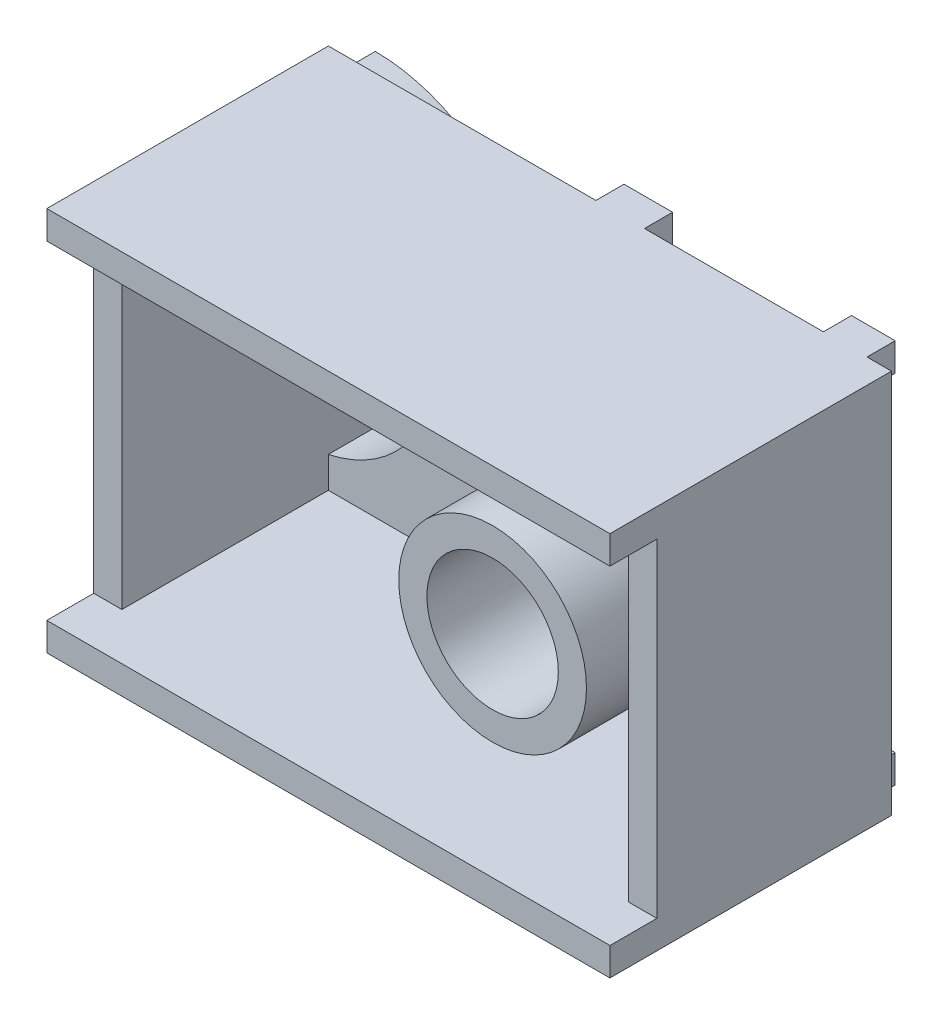
ISO-10303-21;
HEADER;
FILE_DESCRIPTION(('STEP AP214'),'2;1');
FILE_NAME('part.step','',(''),(''),'','','');
FILE_SCHEMA(('AUTOMOTIVE_DESIGN { 1 0 10303 214 1 1 1 1 }'));
ENDSEC;
DATA;
#1=APPLICATION_CONTEXT('core data for automotive mechanical design processes');
#2=APPLICATION_PROTOCOL_DEFINITION('international standard','automotive_design',2000,#1);
#3=PRODUCT_CONTEXT('',#1,'mechanical');
#4=PRODUCT('Part','Part','',(#3));
#5=PRODUCT_RELATED_PRODUCT_CATEGORY('part','',(#4));
#6=PRODUCT_DEFINITION_FORMATION('','',#4);
#7=PRODUCT_DEFINITION_CONTEXT('part definition',#1,'design');
#8=PRODUCT_DEFINITION('design','',#6,#7);
#9=PRODUCT_DEFINITION_SHAPE('','',#8);
#10=(LENGTH_UNIT() NAMED_UNIT(*) SI_UNIT(.MILLI.,.METRE.));
#11=(NAMED_UNIT(*) PLANE_ANGLE_UNIT() SI_UNIT($,.RADIAN.));
#12=(NAMED_UNIT(*) SI_UNIT($,.STERADIAN.) SOLID_ANGLE_UNIT());
#13=UNCERTAINTY_MEASURE_WITH_UNIT(LENGTH_MEASURE(1.E-05),#10,'distance_accuracy_value','');
#14=(GEOMETRIC_REPRESENTATION_CONTEXT(3) GLOBAL_UNCERTAINTY_ASSIGNED_CONTEXT((#13)) GLOBAL_UNIT_ASSIGNED_CONTEXT((#10,
#11,#12)) REPRESENTATION_CONTEXT('',''));
#15=CARTESIAN_POINT('',(0.,0.,0.));
#16=DIRECTION('',(0.,0.,1.));
#17=DIRECTION('',(1.,0.,0.));
#18=AXIS2_PLACEMENT_3D('',#15,#16,#17);
#19=CARTESIAN_POINT('',(0.,0.,25.));
#20=DIRECTION('',(0.,0.,1.));
#21=DIRECTION('',(1.,0.,0.));
#22=AXIS2_PLACEMENT_3D('',#19,#20,#21);
#23=PLANE('',#22);
#24=DIRECTION('',(0.,1.,0.));
#25=VECTOR('',#24,1.);
#26=CARTESIAN_POINT('',(28.5,0.,25.));
#27=LINE('',#26,#25);
#28=CARTESIAN_POINT('',(28.5,-17.5,25.));
#29=VERTEX_POINT('',#28);
#30=CARTESIAN_POINT('',(28.5,17.5,25.));
#31=VERTEX_POINT('',#30);
#32=EDGE_CURVE('E271',#29,#31,#27,.T.);
#33=ORIENTED_EDGE('',*,*,#32,.F.);
#34=DIRECTION('',(-1.,0.,0.));
#35=VECTOR('',#34,1.);
#36=CARTESIAN_POINT('',(0.,-17.5,25.));
#37=LINE('',#36,#35);
#38=CARTESIAN_POINT('',(31.5,-17.5,25.));
#39=VERTEX_POINT('',#38);
#40=EDGE_CURVE('E46',#39,#29,#37,.T.);
#41=ORIENTED_EDGE('',*,*,#40,.F.);
#42=DIRECTION('',(0.,1.,0.));
#43=VECTOR('',#42,1.);
#44=CARTESIAN_POINT('',(31.5,0.,25.));
#45=LINE('',#44,#43);
#46=CARTESIAN_POINT('',(31.5,17.5,25.));
#47=VERTEX_POINT('',#46);
#48=EDGE_CURVE('E11',#39,#47,#45,.T.);
#49=ORIENTED_EDGE('',*,*,#48,.T.);
#50=DIRECTION('',(1.,0.,0.));
#51=VECTOR('',#50,1.);
#52=CARTESIAN_POINT('',(0.,17.5,25.));
#53=LINE('',#52,#51);
#54=EDGE_CURVE('E481',#31,#47,#53,.T.);
#55=ORIENTED_EDGE('',*,*,#54,.F.);
#56=EDGE_LOOP('',(#33,#41,#49,#55));
#57=FACE_BOUND('',#56,.T.);
#58=ADVANCED_FACE('F37',(#57),#23,.T.);
#59=CARTESIAN_POINT('',(13.9999999999999,0.,25.));
#60=DIRECTION('',(0.,0.,1.));
#61=DIRECTION('',(1.,0.,0.));
#62=AXIS2_PLACEMENT_3D('',#59,#60,#61);
#63=CIRCLE('',#62,6.99999999999995);
#64=CARTESIAN_POINT('',(20.9999999999999,0.,25.));
#65=VERTEX_POINT('',#64);
#66=EDGE_CURVE('E478',#65,#65,#63,.T.);
#67=ORIENTED_EDGE('',*,*,#66,.F.);
#68=EDGE_LOOP('',(#67));
#69=FACE_BOUND('',#68,.T.);
#70=CARTESIAN_POINT('',(13.9999999999999,0.,25.));
#71=DIRECTION('',(0.,0.,1.));
#72=DIRECTION('',(1.,0.,0.));
#73=AXIS2_PLACEMENT_3D('',#70,#71,#72);
#74=CIRCLE('',#73,9.99999999999995);
#75=CARTESIAN_POINT('',(23.9999999999999,0.,25.));
#76=VERTEX_POINT('',#75);
#77=EDGE_CURVE('E266',#76,#76,#74,.T.);
#78=ORIENTED_EDGE('',*,*,#77,.T.);
#79=EDGE_LOOP('',(#78));
#80=FACE_BOUND('',#79,.T.);
#81=ADVANCED_FACE('F569',(#69,#80),#23,.T.);
#82=CARTESIAN_POINT('',(0.,0.,0.));
#83=DIRECTION('',(0.,0.,1.));
#84=DIRECTION('',(1.,0.,0.));
#85=AXIS2_PLACEMENT_3D('',#82,#83,#84);
#86=PLANE('',#85);
#87=CARTESIAN_POINT('',(13.9999999999999,0.,0.));
#88=DIRECTION('',(0.,0.,1.));
#89=DIRECTION('',(1.,0.,0.));
#90=AXIS2_PLACEMENT_3D('',#87,#88,#89);
#91=CIRCLE('',#90,6.99999999999995);
#92=CARTESIAN_POINT('',(20.9999999999999,0.,0.));
#93=VERTEX_POINT('',#92);
#94=EDGE_CURVE('E475',#93,#93,#91,.T.);
#95=ORIENTED_EDGE('',*,*,#94,.T.);
#96=EDGE_LOOP('',(#95));
#97=FACE_BOUND('',#96,.T.);
#98=DIRECTION('',(0.,1.,0.));
#99=VECTOR('',#98,1.);
#100=CARTESIAN_POINT('',(24.2435404375954,0.,0.));
#101=LINE('',#100,#99);
#102=CARTESIAN_POINT('',(24.2435404375954,17.5,0.));
#103=VERTEX_POINT('',#102);
#104=CARTESIAN_POINT('',(24.2435404375954,20.5,0.));
#105=VERTEX_POINT('',#104);
#106=EDGE_CURVE('E62',#103,#105,#101,.T.);
#107=ORIENTED_EDGE('',*,*,#106,.F.);
#108=DIRECTION('',(-1.,0.,0.));
#109=VECTOR('',#108,1.);
#110=CARTESIAN_POINT('',(0.,17.5,0.));
#111=LINE('',#110,#109);
#112=CARTESIAN_POINT('',(28.8955762469527,17.5,0.));
#113=VERTEX_POINT('',#112);
#114=EDGE_CURVE('E286',#113,#103,#111,.T.);
#115=ORIENTED_EDGE('',*,*,#114,.F.);
#116=DIRECTION('',(0.,1.,0.));
#117=VECTOR('',#116,1.);
#118=CARTESIAN_POINT('',(28.8955762469527,0.,0.));
#119=LINE('',#118,#117);
#120=CARTESIAN_POINT('',(28.8955762469527,20.5,0.));
#121=VERTEX_POINT('',#120);
#122=EDGE_CURVE('E303',#113,#121,#119,.T.);
#123=ORIENTED_EDGE('',*,*,#122,.T.);
#124=DIRECTION('',(1.,0.,0.));
#125=VECTOR('',#124,1.);
#126=CARTESIAN_POINT('',(0.,20.5,0.));
#127=LINE('',#126,#125);
#128=CARTESIAN_POINT('',(31.5,20.5,0.));
#129=VERTEX_POINT('',#128);
#130=EDGE_CURVE('E435',#121,#129,#127,.T.);
#131=ORIENTED_EDGE('',*,*,#130,.T.);
#132=DIRECTION('',(0.,1.,0.));
#133=VECTOR('',#132,1.);
#134=CARTESIAN_POINT('',(31.5,0.,0.));
#135=LINE('',#134,#133);
#136=CARTESIAN_POINT('',(31.5,-20.5,0.));
#137=VERTEX_POINT('',#136);
#138=EDGE_CURVE('E41',#137,#129,#135,.T.);
#139=ORIENTED_EDGE('',*,*,#138,.F.);
#140=DIRECTION('',(-1.,0.,0.));
#141=VECTOR('',#140,1.);
#142=CARTESIAN_POINT('',(0.,-20.5,0.));
#143=LINE('',#142,#141);
#144=CARTESIAN_POINT('',(28.8955762469527,-20.5,0.));
#145=VERTEX_POINT('',#144);
#146=EDGE_CURVE('E420',#137,#145,#143,.T.);
#147=ORIENTED_EDGE('',*,*,#146,.T.);
#148=DIRECTION('',(0.,1.,0.));
#149=VECTOR('',#148,1.);
#150=CARTESIAN_POINT('',(28.8955762469527,0.,0.));
#151=LINE('',#150,#149);
#152=CARTESIAN_POINT('',(28.8955762469527,-17.5,0.));
#153=VERTEX_POINT('',#152);
#154=EDGE_CURVE('E369',#145,#153,#151,.T.);
#155=ORIENTED_EDGE('',*,*,#154,.T.);
#156=DIRECTION('',(1.,0.,0.));
#157=VECTOR('',#156,1.);
#158=CARTESIAN_POINT('',(0.,-17.5,0.));
#159=LINE('',#158,#157);
#160=CARTESIAN_POINT('',(24.2435404375954,-17.5,0.));
#161=VERTEX_POINT('',#160);
#162=EDGE_CURVE('E391',#161,#153,#159,.T.);
#163=ORIENTED_EDGE('',*,*,#162,.F.);
#164=DIRECTION('',(0.,1.,0.));
#165=VECTOR('',#164,1.);
#166=CARTESIAN_POINT('',(24.2435404375954,0.,0.));
#167=LINE('',#166,#165);
#168=CARTESIAN_POINT('',(24.2435404375954,-20.5,0.));
#169=VERTEX_POINT('',#168);
#170=EDGE_CURVE('E382',#169,#161,#167,.T.);
#171=ORIENTED_EDGE('',*,*,#170,.F.);
#172=CARTESIAN_POINT('',(5.18102434088519,-20.5,0.));
#173=VERTEX_POINT('',#172);
#174=EDGE_CURVE('E422',#169,#173,#143,.T.);
#175=ORIENTED_EDGE('',*,*,#174,.T.);
#176=DIRECTION('',(0.,1.,0.));
#177=VECTOR('',#176,1.);
#178=CARTESIAN_POINT('',(5.18102434088519,0.,0.));
#179=LINE('',#178,#177);
#180=CARTESIAN_POINT('',(5.18102434088519,-17.5,0.));
#181=VERTEX_POINT('',#180);
#182=EDGE_CURVE('E339',#173,#181,#179,.T.);
#183=ORIENTED_EDGE('',*,*,#182,.T.);
#184=DIRECTION('',(-1.,0.,0.));
#185=VECTOR('',#184,1.);
#186=CARTESIAN_POINT('',(0.,-17.5,0.));
#187=LINE('',#186,#185);
#188=CARTESIAN_POINT('',(0.,-17.5,0.));
#189=VERTEX_POINT('',#188);
#190=EDGE_CURVE('E362',#181,#189,#187,.T.);
#191=ORIENTED_EDGE('',*,*,#190,.T.);
#192=DIRECTION('',(0.,1.,0.));
#193=VECTOR('',#192,1.);
#194=CARTESIAN_POINT('',(0.,0.,0.));
#195=LINE('',#194,#193);
#196=CARTESIAN_POINT('',(0.,-20.5,0.));
#197=VERTEX_POINT('',#196);
#198=EDGE_CURVE('E352',#197,#189,#195,.T.);
#199=ORIENTED_EDGE('',*,*,#198,.F.);
#200=CARTESIAN_POINT('',(-28.4999999999998,-20.5,0.));
#201=VERTEX_POINT('',#200);
#202=EDGE_CURVE('E399',#197,#201,#143,.T.);
#203=ORIENTED_EDGE('',*,*,#202,.T.);
#204=DIRECTION('',(0.,-1.,0.));
#205=VECTOR('',#204,1.);
#206=CARTESIAN_POINT('',(-28.4999999999999,0.,0.));
#207=LINE('',#206,#205);
#208=CARTESIAN_POINT('',(-28.4999999999998,-17.5,0.));
#209=VERTEX_POINT('',#208);
#210=EDGE_CURVE('E412',#209,#201,#207,.T.);
#211=ORIENTED_EDGE('',*,*,#210,.F.);
#212=CARTESIAN_POINT('',(-28.4999999999999,0.,0.));
#213=DIRECTION('',(0.,0.,1.));
#214=DIRECTION('',(1.,0.,0.));
#215=AXIS2_PLACEMENT_3D('',#212,#213,#214);
#216=CIRCLE('',#215,17.5);
#217=CARTESIAN_POINT('',(-28.4999999999999,17.5,0.));
#218=VERTEX_POINT('',#217);
#219=EDGE_CURVE('E463',#218,#209,#216,.F.);
#220=ORIENTED_EDGE('',*,*,#219,.F.);
#221=DIRECTION('',(0.,1.,0.));
#222=VECTOR('',#221,1.);
#223=CARTESIAN_POINT('',(-28.4999999999999,0.,0.));
#224=LINE('',#223,#222);
#225=CARTESIAN_POINT('',(-28.4999999999999,20.5,0.));
#226=VERTEX_POINT('',#225);
#227=EDGE_CURVE('E440',#218,#226,#224,.T.);
#228=ORIENTED_EDGE('',*,*,#227,.T.);
#229=CARTESIAN_POINT('',(0.,20.5,0.));
#230=VERTEX_POINT('',#229);
#231=EDGE_CURVE('E449',#226,#230,#127,.T.);
#232=ORIENTED_EDGE('',*,*,#231,.T.);
#233=DIRECTION('',(0.,1.,0.));
#234=VECTOR('',#233,1.);
#235=CARTESIAN_POINT('',(0.,0.,0.));
#236=LINE('',#235,#234);
#237=CARTESIAN_POINT('',(0.,17.5,0.));
#238=VERTEX_POINT('',#237);
#239=EDGE_CURVE('E322',#238,#230,#236,.T.);
#240=ORIENTED_EDGE('',*,*,#239,.F.);
#241=DIRECTION('',(1.,0.,0.));
#242=VECTOR('',#241,1.);
#243=CARTESIAN_POINT('',(0.,17.5,0.));
#244=LINE('',#243,#242);
#245=CARTESIAN_POINT('',(5.18102434088519,17.5,0.));
#246=VERTEX_POINT('',#245);
#247=EDGE_CURVE('E309',#238,#246,#244,.T.);
#248=ORIENTED_EDGE('',*,*,#247,.T.);
#249=DIRECTION('',(0.,1.,0.));
#250=VECTOR('',#249,1.);
#251=CARTESIAN_POINT('',(5.18102434088519,0.,0.));
#252=LINE('',#251,#250);
#253=CARTESIAN_POINT('',(5.18102434088519,20.5,0.));
#254=VERTEX_POINT('',#253);
#255=EDGE_CURVE('E331',#246,#254,#252,.T.);
#256=ORIENTED_EDGE('',*,*,#255,.T.);
#257=EDGE_CURVE('E451',#254,#105,#127,.T.);
#258=ORIENTED_EDGE('',*,*,#257,.T.);
#259=EDGE_LOOP('',(#107,#115,#123,#131,#139,#147,#155,#163,#171,#175,#183,#191,#199,#203,#211,
#220,#228,#232,#240,#248,#256,#258));
#260=FACE_BOUND('',#259,.T.);
#261=ADVANCED_FACE('F526',(#97,#260),#86,.F.);
#262=CARTESIAN_POINT('',(-28.4999999999999,0.,25.));
#263=DIRECTION('',(1.,0.,0.));
#264=DIRECTION('',(0.,1.,0.));
#265=AXIS2_PLACEMENT_3D('',#262,#263,#264);
#266=PLANE('',#265);
#267=DIRECTION('',(0.,-1.,0.));
#268=VECTOR('',#267,1.);
#269=CARTESIAN_POINT('',(-28.4999999999999,0.,25.));
#270=LINE('',#269,#268);
#271=CARTESIAN_POINT('',(-28.4999999999999,17.5,25.));
#272=VERTEX_POINT('',#271);
#273=CARTESIAN_POINT('',(-28.4999999999998,-17.5,25.));
#274=VERTEX_POINT('',#273);
#275=EDGE_CURVE('E484',#272,#274,#270,.T.);
#276=ORIENTED_EDGE('',*,*,#275,.F.);
#277=DIRECTION('',(0.,0.,-1.));
#278=VECTOR('',#277,1.);
#279=CARTESIAN_POINT('',(-28.4999999999999,17.5,30.));
#280=LINE('',#279,#278);
#281=CARTESIAN_POINT('',(-28.4999999999999,17.5,30.));
#282=VERTEX_POINT('',#281);
#283=EDGE_CURVE('E448',#282,#272,#280,.T.);
#284=ORIENTED_EDGE('',*,*,#283,.F.);
#285=DIRECTION('',(0.,1.,0.));
#286=VECTOR('',#285,1.);
#287=CARTESIAN_POINT('',(-28.4999999999999,0.,30.));
#288=LINE('',#287,#286);
#289=CARTESIAN_POINT('',(-28.4999999999999,20.5,30.));
#290=VERTEX_POINT('',#289);
#291=EDGE_CURVE('E445',#282,#290,#288,.T.);
#292=ORIENTED_EDGE('',*,*,#291,.T.);
#293=DIRECTION('',(0.,0.,-1.));
#294=VECTOR('',#293,1.);
#295=CARTESIAN_POINT('',(-28.4999999999999,20.5,30.));
#296=LINE('',#295,#294);
#297=EDGE_CURVE('E455',#290,#226,#296,.T.);
#298=ORIENTED_EDGE('',*,*,#297,.T.);
#299=ORIENTED_EDGE('',*,*,#227,.F.);
#300=DIRECTION('',(0.,0.,1.));
#301=VECTOR('',#300,1.);
#302=CARTESIAN_POINT('',(-28.4999999999999,17.5,-5.));
#303=LINE('',#302,#301);
#304=CARTESIAN_POINT('',(-28.4999999999999,17.5,-5.));
#305=VERTEX_POINT('',#304);
#306=EDGE_CURVE('E469',#305,#218,#303,.T.);
#307=ORIENTED_EDGE('',*,*,#306,.F.);
#308=DIRECTION('',(0.,-1.,0.));
#309=VECTOR('',#308,1.);
#310=CARTESIAN_POINT('',(-28.4999999999999,0.,-5.));
#311=LINE('',#310,#309);
#312=CARTESIAN_POINT('',(-28.4999999999998,-17.5,-5.));
#313=VERTEX_POINT('',#312);
#314=EDGE_CURVE('E466',#305,#313,#311,.T.);
#315=ORIENTED_EDGE('',*,*,#314,.T.);
#316=DIRECTION('',(0.,0.,1.));
#317=VECTOR('',#316,1.);
#318=CARTESIAN_POINT('',(-28.4999999999998,-17.5,-5.));
#319=LINE('',#318,#317);
#320=EDGE_CURVE('E472',#313,#209,#319,.T.);
#321=ORIENTED_EDGE('',*,*,#320,.T.);
#322=ORIENTED_EDGE('',*,*,#210,.T.);
#323=DIRECTION('',(0.,0.,-1.));
#324=VECTOR('',#323,1.);
#325=CARTESIAN_POINT('',(-28.4999999999998,-20.5,30.));
#326=LINE('',#325,#324);
#327=CARTESIAN_POINT('',(-28.4999999999998,-20.5,30.));
#328=VERTEX_POINT('',#327);
#329=EDGE_CURVE('E419',#328,#201,#326,.T.);
#330=ORIENTED_EDGE('',*,*,#329,.F.);
#331=DIRECTION('',(0.,-1.,0.));
#332=VECTOR('',#331,1.);
#333=CARTESIAN_POINT('',(-28.4999999999999,0.,30.));
#334=LINE('',#333,#332);
#335=CARTESIAN_POINT('',(-28.4999999999998,-17.5,30.));
#336=VERTEX_POINT('',#335);
#337=EDGE_CURVE('E417',#336,#328,#334,.T.);
#338=ORIENTED_EDGE('',*,*,#337,.F.);
#339=DIRECTION('',(0.,0.,-1.));
#340=VECTOR('',#339,1.);
#341=CARTESIAN_POINT('',(-28.4999999999998,-17.5,30.));
#342=LINE('',#341,#340);
#343=EDGE_CURVE('E427',#336,#274,#342,.T.);
#344=ORIENTED_EDGE('',*,*,#343,.T.);
#345=EDGE_LOOP('',(#276,#284,#292,#298,#299,#307,#315,#321,#322,#330,#338,#344));
#346=FACE_BOUND('',#345,.T.);
#347=ADVANCED_FACE('F506',(#346),#266,.F.);
#348=CARTESIAN_POINT('',(13.9999999999999,0.,25.));
#349=DIRECTION('',(0.,0.,-1.));
#350=DIRECTION('',(-1.,0.,0.));
#351=AXIS2_PLACEMENT_3D('',#348,#349,#350);
#352=CYLINDRICAL_SURFACE('',#351,6.99999999999995);
#353=ORIENTED_EDGE('',*,*,#66,.T.);
#354=EDGE_LOOP('',(#353));
#355=FACE_BOUND('',#354,.T.);
#356=ORIENTED_EDGE('',*,*,#94,.F.);
#357=EDGE_LOOP('',(#356));
#358=FACE_BOUND('',#357,.T.);
#359=ADVANCED_FACE('F39',(#355,#358),#352,.F.);
#360=CARTESIAN_POINT('',(31.5,0.,25.));
#361=DIRECTION('',(-1.,0.,0.));
#362=DIRECTION('',(0.,-1.,0.));
#363=AXIS2_PLACEMENT_3D('',#360,#361,#362);
#364=PLANE('',#363);
#365=ORIENTED_EDGE('',*,*,#138,.T.);
#366=DIRECTION('',(0.,0.,-1.));
#367=VECTOR('',#366,1.);
#368=CARTESIAN_POINT('',(31.5,20.5,30.));
#369=LINE('',#368,#367);
#370=CARTESIAN_POINT('',(31.5,20.5,30.));
#371=VERTEX_POINT('',#370);
#372=EDGE_CURVE('E457',#371,#129,#369,.T.);
#373=ORIENTED_EDGE('',*,*,#372,.F.);
#374=DIRECTION('',(0.,1.,0.));
#375=VECTOR('',#374,1.);
#376=CARTESIAN_POINT('',(31.5,0.,30.));
#377=LINE('',#376,#375);
#378=CARTESIAN_POINT('',(31.5,17.5,30.));
#379=VERTEX_POINT('',#378);
#380=EDGE_CURVE('E439',#379,#371,#377,.T.);
#381=ORIENTED_EDGE('',*,*,#380,.F.);
#382=DIRECTION('',(0.,0.,-1.));
#383=VECTOR('',#382,1.);
#384=CARTESIAN_POINT('',(31.5,17.5,30.));
#385=LINE('',#384,#383);
#386=EDGE_CURVE('E460',#379,#47,#385,.T.);
#387=ORIENTED_EDGE('',*,*,#386,.T.);
#388=ORIENTED_EDGE('',*,*,#48,.F.);
#389=DIRECTION('',(0.,0.,-1.));
#390=VECTOR('',#389,1.);
#391=CARTESIAN_POINT('',(31.5,-17.5,30.));
#392=LINE('',#391,#390);
#393=CARTESIAN_POINT('',(31.5,-17.5,30.));
#394=VERTEX_POINT('',#393);
#395=EDGE_CURVE('E430',#394,#39,#392,.T.);
#396=ORIENTED_EDGE('',*,*,#395,.F.);
#397=DIRECTION('',(0.,-1.,0.));
#398=VECTOR('',#397,1.);
#399=CARTESIAN_POINT('',(31.5,0.,30.));
#400=LINE('',#399,#398);
#401=CARTESIAN_POINT('',(31.5,-20.5,30.));
#402=VERTEX_POINT('',#401);
#403=EDGE_CURVE('E411',#394,#402,#400,.T.);
#404=ORIENTED_EDGE('',*,*,#403,.T.);
#405=DIRECTION('',(0.,0.,-1.));
#406=VECTOR('',#405,1.);
#407=CARTESIAN_POINT('',(31.5,-20.5,30.));
#408=LINE('',#407,#406);
#409=EDGE_CURVE('E432',#402,#137,#408,.T.);
#410=ORIENTED_EDGE('',*,*,#409,.T.);
#411=EDGE_LOOP('',(#365,#373,#381,#387,#388,#396,#404,#410));
#412=FACE_BOUND('',#411,.T.);
#413=ADVANCED_FACE('F495',(#412),#364,.F.);
#414=DIRECTION('',(0.,-1.,0.));
#415=VECTOR('',#414,1.);
#416=CARTESIAN_POINT('',(-25.4999999999999,0.,25.));
#417=LINE('',#416,#415);
#418=CARTESIAN_POINT('',(-25.4999999999999,17.5,25.));
#419=VERTEX_POINT('',#418);
#420=CARTESIAN_POINT('',(-25.4999999999998,-17.5,25.));
#421=VERTEX_POINT('',#420);
#422=EDGE_CURVE('E283',#419,#421,#417,.T.);
#423=ORIENTED_EDGE('',*,*,#422,.F.);
#424=EDGE_CURVE('E482',#272,#419,#53,.T.);
#425=ORIENTED_EDGE('',*,*,#424,.F.);
#426=ORIENTED_EDGE('',*,*,#275,.T.);
#427=EDGE_CURVE('E487',#421,#274,#37,.T.);
#428=ORIENTED_EDGE('',*,*,#427,.F.);
#429=EDGE_LOOP('',(#423,#425,#426,#428));
#430=FACE_BOUND('',#429,.T.);
#431=ADVANCED_FACE('F571',(#430),#23,.T.);
#432=CARTESIAN_POINT('',(-28.4999999999999,0.,-5.));
#433=DIRECTION('',(0.,0.,1.));
#434=DIRECTION('',(1.,0.,0.));
#435=AXIS2_PLACEMENT_3D('',#432,#433,#434);
#436=CYLINDRICAL_SURFACE('',#435,17.5);
#437=ORIENTED_EDGE('',*,*,#219,.T.);
#438=ORIENTED_EDGE('',*,*,#320,.F.);
#439=CARTESIAN_POINT('',(-28.4999999999999,0.,-5.));
#440=DIRECTION('',(0.,0.,1.));
#441=DIRECTION('',(1.,0.,0.));
#442=AXIS2_PLACEMENT_3D('',#439,#440,#441);
#443=CIRCLE('',#442,17.5);
#444=EDGE_CURVE('E464',#305,#313,#443,.F.);
#445=ORIENTED_EDGE('',*,*,#444,.F.);
#446=ORIENTED_EDGE('',*,*,#306,.T.);
#447=EDGE_LOOP('',(#437,#438,#445,#446));
#448=FACE_BOUND('',#447,.T.);
#449=ADVANCED_FACE('F579',(#448),#436,.T.);
#450=CARTESIAN_POINT('',(0.,0.,-5.));
#451=DIRECTION('',(0.,0.,1.));
#452=DIRECTION('',(1.,0.,0.));
#453=AXIS2_PLACEMENT_3D('',#450,#451,#452);
#454=PLANE('',#453);
#455=ORIENTED_EDGE('',*,*,#444,.T.);
#456=ORIENTED_EDGE('',*,*,#314,.F.);
#457=EDGE_LOOP('',(#455,#456));
#458=FACE_BOUND('',#457,.T.);
#459=ADVANCED_FACE('F585',(#458),#454,.F.);
#460=CARTESIAN_POINT('',(0.,17.5,30.));
#461=DIRECTION('',(0.,1.,0.));
#462=DIRECTION('',(-1.,0.,0.));
#463=AXIS2_PLACEMENT_3D('',#460,#461,#462);
#464=PLANE('',#463);
#465=ORIENTED_EDGE('',*,*,#424,.T.);
#466=DIRECTION('',(0.,0.,-1.));
#467=VECTOR('',#466,1.);
#468=CARTESIAN_POINT('',(-25.4999999999999,17.5,30.));
#469=LINE('',#468,#467);
#470=CARTESIAN_POINT('',(-25.4999999999999,17.5,3.));
#471=VERTEX_POINT('',#470);
#472=EDGE_CURVE('E54',#419,#471,#469,.T.);
#473=ORIENTED_EDGE('',*,*,#472,.T.);
#474=DIRECTION('',(1.,0.,0.));
#475=VECTOR('',#474,1.);
#476=CARTESIAN_POINT('',(0.,17.5,3.));
#477=LINE('',#476,#475);
#478=CARTESIAN_POINT('',(28.5,17.5,3.));
#479=VERTEX_POINT('',#478);
#480=EDGE_CURVE('E248',#471,#479,#477,.T.);
#481=ORIENTED_EDGE('',*,*,#480,.T.);
#482=DIRECTION('',(0.,0.,-1.));
#483=VECTOR('',#482,1.);
#484=CARTESIAN_POINT('',(28.5,17.5,25.));
#485=LINE('',#484,#483);
#486=EDGE_CURVE('E253',#31,#479,#485,.T.);
#487=ORIENTED_EDGE('',*,*,#486,.F.);
#488=ORIENTED_EDGE('',*,*,#54,.T.);
#489=ORIENTED_EDGE('',*,*,#386,.F.);
#490=DIRECTION('',(1.,0.,0.));
#491=VECTOR('',#490,1.);
#492=CARTESIAN_POINT('',(0.,17.5,30.));
#493=LINE('',#492,#491);
#494=EDGE_CURVE('E436',#282,#379,#493,.T.);
#495=ORIENTED_EDGE('',*,*,#494,.F.);
#496=ORIENTED_EDGE('',*,*,#283,.T.);
#497=EDGE_LOOP('',(#465,#473,#481,#487,#488,#489,#495,#496));
#498=FACE_BOUND('',#497,.T.);
#499=ADVANCED_FACE('F251',(#498),#464,.F.);
#500=CARTESIAN_POINT('',(0.,20.5,30.));
#501=DIRECTION('',(0.,1.,0.));
#502=DIRECTION('',(-1.,0.,0.));
#503=AXIS2_PLACEMENT_3D('',#500,#501,#502);
#504=PLANE('',#503);
#505=ORIENTED_EDGE('',*,*,#231,.F.);
#506=ORIENTED_EDGE('',*,*,#297,.F.);
#507=DIRECTION('',(1.,0.,0.));
#508=VECTOR('',#507,1.);
#509=CARTESIAN_POINT('',(0.,20.5,30.));
#510=LINE('',#509,#508);
#511=EDGE_CURVE('E442',#290,#371,#510,.T.);
#512=ORIENTED_EDGE('',*,*,#511,.T.);
#513=ORIENTED_EDGE('',*,*,#372,.T.);
#514=ORIENTED_EDGE('',*,*,#130,.F.);
#515=DIRECTION('',(0.,0.,1.));
#516=VECTOR('',#515,1.);
#517=CARTESIAN_POINT('',(28.8955762469527,20.5,-3.));
#518=LINE('',#517,#516);
#519=CARTESIAN_POINT('',(28.8955762469527,20.5,-3.));
#520=VERTEX_POINT('',#519);
#521=EDGE_CURVE('E313',#520,#121,#518,.T.);
#522=ORIENTED_EDGE('',*,*,#521,.F.);
#523=DIRECTION('',(-1.,0.,0.));
#524=VECTOR('',#523,1.);
#525=CARTESIAN_POINT('',(0.,20.5,-3.));
#526=LINE('',#525,#524);
#527=CARTESIAN_POINT('',(24.2435404375954,20.5,-3.));
#528=VERTEX_POINT('',#527);
#529=EDGE_CURVE('E295',#520,#528,#526,.T.);
#530=ORIENTED_EDGE('',*,*,#529,.T.);
#531=DIRECTION('',(0.,0.,1.));
#532=VECTOR('',#531,1.);
#533=CARTESIAN_POINT('',(24.2435404375954,20.5,-3.));
#534=LINE('',#533,#532);
#535=EDGE_CURVE('E310',#528,#105,#534,.T.);
#536=ORIENTED_EDGE('',*,*,#535,.T.);
#537=ORIENTED_EDGE('',*,*,#257,.F.);
#538=DIRECTION('',(0.,0.,1.));
#539=VECTOR('',#538,1.);
#540=CARTESIAN_POINT('',(5.18102434088519,20.5,-3.));
#541=LINE('',#540,#539);
#542=CARTESIAN_POINT('',(5.18102434088519,20.5,-3.));
#543=VERTEX_POINT('',#542);
#544=EDGE_CURVE('E343',#543,#254,#541,.T.);
#545=ORIENTED_EDGE('',*,*,#544,.F.);
#546=DIRECTION('',(1.,0.,0.));
#547=VECTOR('',#546,1.);
#548=CARTESIAN_POINT('',(0.,20.5,-3.));
#549=LINE('',#548,#547);
#550=CARTESIAN_POINT('',(0.,20.5,-3.));
#551=VERTEX_POINT('',#550);
#552=EDGE_CURVE('E325',#551,#543,#549,.T.);
#553=ORIENTED_EDGE('',*,*,#552,.F.);
#554=DIRECTION('',(0.,0.,1.));
#555=VECTOR('',#554,1.);
#556=CARTESIAN_POINT('',(0.,20.5,-3.));
#557=LINE('',#556,#555);
#558=EDGE_CURVE('E340',#551,#230,#557,.T.);
#559=ORIENTED_EDGE('',*,*,#558,.T.);
#560=EDGE_LOOP('',(#505,#506,#512,#513,#514,#522,#530,#536,#537,#545,#553,#559));
#561=FACE_BOUND('',#560,.T.);
#562=ADVANCED_FACE('F499',(#561),#504,.T.);
#563=CARTESIAN_POINT('',(0.,0.,30.));
#564=DIRECTION('',(0.,0.,1.));
#565=DIRECTION('',(1.,0.,0.));
#566=AXIS2_PLACEMENT_3D('',#563,#564,#565);
#567=PLANE('',#566);
#568=ORIENTED_EDGE('',*,*,#494,.T.);
#569=ORIENTED_EDGE('',*,*,#380,.T.);
#570=ORIENTED_EDGE('',*,*,#511,.F.);
#571=ORIENTED_EDGE('',*,*,#291,.F.);
#572=EDGE_LOOP('',(#568,#569,#570,#571));
#573=FACE_BOUND('',#572,.T.);
#574=ADVANCED_FACE('F503',(#573),#567,.T.);
#575=CARTESIAN_POINT('',(0.,-20.5,30.));
#576=DIRECTION('',(0.,-1.,0.));
#577=DIRECTION('',(0.,0.,-1.));
#578=AXIS2_PLACEMENT_3D('',#575,#576,#577);
#579=PLANE('',#578);
#580=ORIENTED_EDGE('',*,*,#146,.F.);
#581=ORIENTED_EDGE('',*,*,#409,.F.);
#582=DIRECTION('',(-1.,0.,0.));
#583=VECTOR('',#582,1.);
#584=CARTESIAN_POINT('',(0.,-20.5,30.));
#585=LINE('',#584,#583);
#586=EDGE_CURVE('E408',#402,#328,#585,.T.);
#587=ORIENTED_EDGE('',*,*,#586,.T.);
#588=ORIENTED_EDGE('',*,*,#329,.T.);
#589=ORIENTED_EDGE('',*,*,#202,.F.);
#590=DIRECTION('',(0.,0.,1.));
#591=VECTOR('',#590,1.);
#592=CARTESIAN_POINT('',(0.,-20.5,-3.));
#593=LINE('',#592,#591);
#594=CARTESIAN_POINT('',(0.,-20.5,-3.));
#595=VERTEX_POINT('',#594);
#596=EDGE_CURVE('E366',#595,#197,#593,.T.);
#597=ORIENTED_EDGE('',*,*,#596,.F.);
#598=DIRECTION('',(-1.,0.,0.));
#599=VECTOR('',#598,1.);
#600=CARTESIAN_POINT('',(0.,-20.5,-3.));
#601=LINE('',#600,#599);
#602=CARTESIAN_POINT('',(5.18102434088519,-20.5,-3.));
#603=VERTEX_POINT('',#602);
#604=EDGE_CURVE('E348',#603,#595,#601,.T.);
#605=ORIENTED_EDGE('',*,*,#604,.F.);
#606=DIRECTION('',(0.,0.,1.));
#607=VECTOR('',#606,1.);
#608=CARTESIAN_POINT('',(5.18102434088519,-20.5,-3.));
#609=LINE('',#608,#607);
#610=EDGE_CURVE('E360',#603,#173,#609,.T.);
#611=ORIENTED_EDGE('',*,*,#610,.T.);
#612=ORIENTED_EDGE('',*,*,#174,.F.);
#613=DIRECTION('',(0.,0.,1.));
#614=VECTOR('',#613,1.);
#615=CARTESIAN_POINT('',(24.2435404375954,-20.5,-3.));
#616=LINE('',#615,#614);
#617=CARTESIAN_POINT('',(24.2435404375954,-20.5,-3.));
#618=VERTEX_POINT('',#617);
#619=EDGE_CURVE('E396',#618,#169,#616,.T.);
#620=ORIENTED_EDGE('',*,*,#619,.F.);
#621=DIRECTION('',(1.,0.,0.));
#622=VECTOR('',#621,1.);
#623=CARTESIAN_POINT('',(0.,-20.5,-3.));
#624=LINE('',#623,#622);
#625=CARTESIAN_POINT('',(28.8955762469527,-20.5,-3.));
#626=VERTEX_POINT('',#625);
#627=EDGE_CURVE('E378',#618,#626,#624,.T.);
#628=ORIENTED_EDGE('',*,*,#627,.T.);
#629=DIRECTION('',(0.,0.,1.));
#630=VECTOR('',#629,1.);
#631=CARTESIAN_POINT('',(28.8955762469527,-20.5,-3.));
#632=LINE('',#631,#630);
#633=EDGE_CURVE('E389',#626,#145,#632,.T.);
#634=ORIENTED_EDGE('',*,*,#633,.T.);
#635=EDGE_LOOP('',(#580,#581,#587,#588,#589,#597,#605,#611,#612,#620,#628,#634));
#636=FACE_BOUND('',#635,.T.);
#637=ADVANCED_FACE('F524',(#636),#579,.T.);
#638=CARTESIAN_POINT('',(0.,-17.5,30.));
#639=DIRECTION('',(0.,-1.,0.));
#640=DIRECTION('',(0.,0.,-1.));
#641=AXIS2_PLACEMENT_3D('',#638,#639,#640);
#642=PLANE('',#641);
#643=ORIENTED_EDGE('',*,*,#40,.T.);
#644=DIRECTION('',(0.,0.,-1.));
#645=VECTOR('',#644,1.);
#646=CARTESIAN_POINT('',(28.5,-17.5,30.));
#647=LINE('',#646,#645);
#648=CARTESIAN_POINT('',(28.5,-17.5,3.));
#649=VERTEX_POINT('',#648);
#650=EDGE_CURVE('E257',#29,#649,#647,.T.);
#651=ORIENTED_EDGE('',*,*,#650,.T.);
#652=DIRECTION('',(-1.,0.,0.));
#653=VECTOR('',#652,1.);
#654=CARTESIAN_POINT('',(0.,-17.5,3.));
#655=LINE('',#654,#653);
#656=CARTESIAN_POINT('',(-25.4999999999998,-17.5,3.));
#657=VERTEX_POINT('',#656);
#658=EDGE_CURVE('E264',#649,#657,#655,.T.);
#659=ORIENTED_EDGE('',*,*,#658,.T.);
#660=DIRECTION('',(0.,0.,-1.));
#661=VECTOR('',#660,1.);
#662=CARTESIAN_POINT('',(-25.4999999999998,-17.5,25.));
#663=LINE('',#662,#661);
#664=EDGE_CURVE('E282',#421,#657,#663,.T.);
#665=ORIENTED_EDGE('',*,*,#664,.F.);
#666=ORIENTED_EDGE('',*,*,#427,.T.);
#667=ORIENTED_EDGE('',*,*,#343,.F.);
#668=DIRECTION('',(-1.,0.,0.));
#669=VECTOR('',#668,1.);
#670=CARTESIAN_POINT('',(0.,-17.5,30.));
#671=LINE('',#670,#669);
#672=EDGE_CURVE('E415',#394,#336,#671,.T.);
#673=ORIENTED_EDGE('',*,*,#672,.F.);
#674=ORIENTED_EDGE('',*,*,#395,.T.);
#675=EDGE_LOOP('',(#643,#651,#659,#665,#666,#667,#673,#674));
#676=FACE_BOUND('',#675,.T.);
#677=ADVANCED_FACE('F514',(#676),#642,.F.);
#678=CARTESIAN_POINT('',(0.,0.,30.));
#679=DIRECTION('',(0.,0.,1.));
#680=DIRECTION('',(1.,0.,0.));
#681=AXIS2_PLACEMENT_3D('',#678,#679,#680);
#682=PLANE('',#681);
#683=ORIENTED_EDGE('',*,*,#586,.F.);
#684=ORIENTED_EDGE('',*,*,#403,.F.);
#685=ORIENTED_EDGE('',*,*,#672,.T.);
#686=ORIENTED_EDGE('',*,*,#337,.T.);
#687=EDGE_LOOP('',(#683,#684,#685,#686));
#688=FACE_BOUND('',#687,.T.);
#689=ADVANCED_FACE('F520',(#688),#682,.T.);
#690=CARTESIAN_POINT('',(24.2435404375954,0.,-3.));
#691=DIRECTION('',(1.,0.,0.));
#692=DIRECTION('',(0.,0.,-1.));
#693=AXIS2_PLACEMENT_3D('',#690,#691,#692);
#694=PLANE('',#693);
#695=ORIENTED_EDGE('',*,*,#170,.T.);
#696=DIRECTION('',(0.,0.,1.));
#697=VECTOR('',#696,1.);
#698=CARTESIAN_POINT('',(24.2435404375954,-17.5,-3.));
#699=LINE('',#698,#697);
#700=CARTESIAN_POINT('',(24.2435404375954,-17.5,-3.));
#701=VERTEX_POINT('',#700);
#702=EDGE_CURVE('E400',#701,#161,#699,.T.);
#703=ORIENTED_EDGE('',*,*,#702,.F.);
#704=DIRECTION('',(0.,1.,0.));
#705=VECTOR('',#704,1.);
#706=CARTESIAN_POINT('',(24.2435404375954,0.,-3.));
#707=LINE('',#706,#705);
#708=EDGE_CURVE('E387',#618,#701,#707,.T.);
#709=ORIENTED_EDGE('',*,*,#708,.F.);
#710=ORIENTED_EDGE('',*,*,#619,.T.);
#711=EDGE_LOOP('',(#695,#703,#709,#710));
#712=FACE_BOUND('',#711,.T.);
#713=ADVANCED_FACE('F538',(#712),#694,.F.);
#714=CARTESIAN_POINT('',(0.,-17.5,-3.));
#715=DIRECTION('',(0.,-1.,0.));
#716=DIRECTION('',(0.,0.,-1.));
#717=AXIS2_PLACEMENT_3D('',#714,#715,#716);
#718=PLANE('',#717);
#719=ORIENTED_EDGE('',*,*,#162,.T.);
#720=DIRECTION('',(0.,0.,1.));
#721=VECTOR('',#720,1.);
#722=CARTESIAN_POINT('',(28.8955762469527,-17.5,-3.));
#723=LINE('',#722,#721);
#724=CARTESIAN_POINT('',(28.8955762469527,-17.5,-3.));
#725=VERTEX_POINT('',#724);
#726=EDGE_CURVE('E403',#725,#153,#723,.T.);
#727=ORIENTED_EDGE('',*,*,#726,.F.);
#728=DIRECTION('',(1.,0.,0.));
#729=VECTOR('',#728,1.);
#730=CARTESIAN_POINT('',(0.,-17.5,-3.));
#731=LINE('',#730,#729);
#732=EDGE_CURVE('E385',#701,#725,#731,.T.);
#733=ORIENTED_EDGE('',*,*,#732,.F.);
#734=ORIENTED_EDGE('',*,*,#702,.T.);
#735=EDGE_LOOP('',(#719,#727,#733,#734));
#736=FACE_BOUND('',#735,.T.);
#737=ADVANCED_FACE('F534',(#736),#718,.F.);
#738=CARTESIAN_POINT('',(28.8955762469527,0.,-3.));
#739=DIRECTION('',(1.,0.,0.));
#740=DIRECTION('',(0.,0.,-1.));
#741=AXIS2_PLACEMENT_3D('',#738,#739,#740);
#742=PLANE('',#741);
#743=ORIENTED_EDGE('',*,*,#154,.F.);
#744=ORIENTED_EDGE('',*,*,#633,.F.);
#745=DIRECTION('',(0.,1.,0.));
#746=VECTOR('',#745,1.);
#747=CARTESIAN_POINT('',(28.8955762469527,0.,-3.));
#748=LINE('',#747,#746);
#749=EDGE_CURVE('E381',#626,#725,#748,.T.);
#750=ORIENTED_EDGE('',*,*,#749,.T.);
#751=ORIENTED_EDGE('',*,*,#726,.T.);
#752=EDGE_LOOP('',(#743,#744,#750,#751));
#753=FACE_BOUND('',#752,.T.);
#754=ADVANCED_FACE('F530',(#753),#742,.T.);
#755=CARTESIAN_POINT('',(0.,0.,-3.));
#756=DIRECTION('',(0.,0.,1.));
#757=DIRECTION('',(1.,0.,0.));
#758=AXIS2_PLACEMENT_3D('',#755,#756,#757);
#759=PLANE('',#758);
#760=ORIENTED_EDGE('',*,*,#627,.F.);
#761=ORIENTED_EDGE('',*,*,#708,.T.);
#762=ORIENTED_EDGE('',*,*,#732,.T.);
#763=ORIENTED_EDGE('',*,*,#749,.F.);
#764=EDGE_LOOP('',(#760,#761,#762,#763));
#765=FACE_BOUND('',#764,.T.);
#766=ADVANCED_FACE('F697',(#765),#759,.F.);
#767=CARTESIAN_POINT('',(0.,0.,-3.));
#768=DIRECTION('',(1.,0.,0.));
#769=DIRECTION('',(0.,0.,-1.));
#770=AXIS2_PLACEMENT_3D('',#767,#768,#769);
#771=PLANE('',#770);
#772=ORIENTED_EDGE('',*,*,#198,.T.);
#773=DIRECTION('',(0.,0.,1.));
#774=VECTOR('',#773,1.);
#775=CARTESIAN_POINT('',(0.,-17.5,-3.));
#776=LINE('',#775,#774);
#777=CARTESIAN_POINT('',(0.,-17.5,-3.));
#778=VERTEX_POINT('',#777);
#779=EDGE_CURVE('E370',#778,#189,#776,.T.);
#780=ORIENTED_EDGE('',*,*,#779,.F.);
#781=DIRECTION('',(0.,1.,0.));
#782=VECTOR('',#781,1.);
#783=CARTESIAN_POINT('',(0.,0.,-3.));
#784=LINE('',#783,#782);
#785=EDGE_CURVE('E358',#595,#778,#784,.T.);
#786=ORIENTED_EDGE('',*,*,#785,.F.);
#787=ORIENTED_EDGE('',*,*,#596,.T.);
#788=EDGE_LOOP('',(#772,#780,#786,#787));
#789=FACE_BOUND('',#788,.T.);
#790=ADVANCED_FACE('F553',(#789),#771,.F.);
#791=CARTESIAN_POINT('',(0.,-17.5,-3.));
#792=DIRECTION('',(0.,1.,0.));
#793=DIRECTION('',(0.,0.,1.));
#794=AXIS2_PLACEMENT_3D('',#791,#792,#793);
#795=PLANE('',#794);
#796=ORIENTED_EDGE('',*,*,#190,.F.);
#797=DIRECTION('',(0.,0.,1.));
#798=VECTOR('',#797,1.);
#799=CARTESIAN_POINT('',(5.18102434088519,-17.5,-3.));
#800=LINE('',#799,#798);
#801=CARTESIAN_POINT('',(5.18102434088519,-17.5,-3.));
#802=VERTEX_POINT('',#801);
#803=EDGE_CURVE('E373',#802,#181,#800,.T.);
#804=ORIENTED_EDGE('',*,*,#803,.F.);
#805=DIRECTION('',(-1.,0.,0.));
#806=VECTOR('',#805,1.);
#807=CARTESIAN_POINT('',(0.,-17.5,-3.));
#808=LINE('',#807,#806);
#809=EDGE_CURVE('E355',#802,#778,#808,.T.);
#810=ORIENTED_EDGE('',*,*,#809,.T.);
#811=ORIENTED_EDGE('',*,*,#779,.T.);
#812=EDGE_LOOP('',(#796,#804,#810,#811));
#813=FACE_BOUND('',#812,.T.);
#814=ADVANCED_FACE('F549',(#813),#795,.T.);
#815=CARTESIAN_POINT('',(5.18102434088519,0.,-3.));
#816=DIRECTION('',(1.,0.,0.));
#817=DIRECTION('',(0.,0.,-1.));
#818=AXIS2_PLACEMENT_3D('',#815,#816,#817);
#819=PLANE('',#818);
#820=ORIENTED_EDGE('',*,*,#182,.F.);
#821=ORIENTED_EDGE('',*,*,#610,.F.);
#822=DIRECTION('',(0.,1.,0.));
#823=VECTOR('',#822,1.);
#824=CARTESIAN_POINT('',(5.18102434088519,0.,-3.));
#825=LINE('',#824,#823);
#826=EDGE_CURVE('E351',#603,#802,#825,.T.);
#827=ORIENTED_EDGE('',*,*,#826,.T.);
#828=ORIENTED_EDGE('',*,*,#803,.T.);
#829=EDGE_LOOP('',(#820,#821,#827,#828));
#830=FACE_BOUND('',#829,.T.);
#831=ADVANCED_FACE('F545',(#830),#819,.T.);
#832=CARTESIAN_POINT('',(0.,0.,-3.));
#833=DIRECTION('',(0.,0.,1.));
#834=DIRECTION('',(1.,0.,0.));
#835=AXIS2_PLACEMENT_3D('',#832,#833,#834);
#836=PLANE('',#835);
#837=ORIENTED_EDGE('',*,*,#604,.T.);
#838=ORIENTED_EDGE('',*,*,#785,.T.);
#839=ORIENTED_EDGE('',*,*,#809,.F.);
#840=ORIENTED_EDGE('',*,*,#826,.F.);
#841=EDGE_LOOP('',(#837,#838,#839,#840));
#842=FACE_BOUND('',#841,.T.);
#843=ADVANCED_FACE('F555',(#842),#836,.F.);
#844=CARTESIAN_POINT('',(0.,17.5,-3.));
#845=DIRECTION('',(0.,-1.,0.));
#846=DIRECTION('',(1.,0.,0.));
#847=AXIS2_PLACEMENT_3D('',#844,#845,#846);
#848=PLANE('',#847);
#849=ORIENTED_EDGE('',*,*,#247,.F.);
#850=DIRECTION('',(0.,0.,1.));
#851=VECTOR('',#850,1.);
#852=CARTESIAN_POINT('',(0.,17.5,-3.));
#853=LINE('',#852,#851);
#854=CARTESIAN_POINT('',(0.,17.5,-3.));
#855=VERTEX_POINT('',#854);
#856=EDGE_CURVE('E336',#855,#238,#853,.T.);
#857=ORIENTED_EDGE('',*,*,#856,.F.);
#858=DIRECTION('',(1.,0.,0.));
#859=VECTOR('',#858,1.);
#860=CARTESIAN_POINT('',(0.,17.5,-3.));
#861=LINE('',#860,#859);
#862=CARTESIAN_POINT('',(5.18102434088519,17.5,-3.));
#863=VERTEX_POINT('',#862);
#864=EDGE_CURVE('E318',#855,#863,#861,.T.);
#865=ORIENTED_EDGE('',*,*,#864,.T.);
#866=DIRECTION('',(0.,0.,1.));
#867=VECTOR('',#866,1.);
#868=CARTESIAN_POINT('',(5.18102434088519,17.5,-3.));
#869=LINE('',#868,#867);
#870=EDGE_CURVE('E329',#863,#246,#869,.T.);
#871=ORIENTED_EDGE('',*,*,#870,.T.);
#872=EDGE_LOOP('',(#849,#857,#865,#871));
#873=FACE_BOUND('',#872,.T.);
#874=ADVANCED_FACE('F557',(#873),#848,.T.);
#875=CARTESIAN_POINT('',(0.,0.,-3.));
#876=DIRECTION('',(1.,0.,0.));
#877=DIRECTION('',(0.,0.,-1.));
#878=AXIS2_PLACEMENT_3D('',#875,#876,#877);
#879=PLANE('',#878);
#880=ORIENTED_EDGE('',*,*,#239,.T.);
#881=ORIENTED_EDGE('',*,*,#558,.F.);
#882=DIRECTION('',(0.,1.,0.));
#883=VECTOR('',#882,1.);
#884=CARTESIAN_POINT('',(0.,0.,-3.));
#885=LINE('',#884,#883);
#886=EDGE_CURVE('E327',#855,#551,#885,.T.);
#887=ORIENTED_EDGE('',*,*,#886,.F.);
#888=ORIENTED_EDGE('',*,*,#856,.T.);
#889=EDGE_LOOP('',(#880,#881,#887,#888));
#890=FACE_BOUND('',#889,.T.);
#891=ADVANCED_FACE('F563',(#890),#879,.F.);
#892=CARTESIAN_POINT('',(5.18102434088519,0.,-3.));
#893=DIRECTION('',(1.,0.,0.));
#894=DIRECTION('',(0.,0.,-1.));
#895=AXIS2_PLACEMENT_3D('',#892,#893,#894);
#896=PLANE('',#895);
#897=ORIENTED_EDGE('',*,*,#255,.F.);
#898=ORIENTED_EDGE('',*,*,#870,.F.);
#899=DIRECTION('',(0.,1.,0.));
#900=VECTOR('',#899,1.);
#901=CARTESIAN_POINT('',(5.18102434088519,0.,-3.));
#902=LINE('',#901,#900);
#903=EDGE_CURVE('E321',#863,#543,#902,.T.);
#904=ORIENTED_EDGE('',*,*,#903,.T.);
#905=ORIENTED_EDGE('',*,*,#544,.T.);
#906=EDGE_LOOP('',(#897,#898,#904,#905));
#907=FACE_BOUND('',#906,.T.);
#908=ADVANCED_FACE('F650',(#907),#896,.T.);
#909=CARTESIAN_POINT('',(0.,0.,-3.));
#910=DIRECTION('',(0.,0.,1.));
#911=DIRECTION('',(1.,0.,0.));
#912=AXIS2_PLACEMENT_3D('',#909,#910,#911);
#913=PLANE('',#912);
#914=ORIENTED_EDGE('',*,*,#864,.F.);
#915=ORIENTED_EDGE('',*,*,#886,.T.);
#916=ORIENTED_EDGE('',*,*,#552,.T.);
#917=ORIENTED_EDGE('',*,*,#903,.F.);
#918=EDGE_LOOP('',(#914,#915,#916,#917));
#919=FACE_BOUND('',#918,.T.);
#920=ADVANCED_FACE('F646',(#919),#913,.F.);
#921=CARTESIAN_POINT('',(0.,17.5,-3.));
#922=DIRECTION('',(0.,1.,0.));
#923=DIRECTION('',(-1.,0.,0.));
#924=AXIS2_PLACEMENT_3D('',#921,#922,#923);
#925=PLANE('',#924);
#926=ORIENTED_EDGE('',*,*,#114,.T.);
#927=DIRECTION('',(0.,0.,1.));
#928=VECTOR('',#927,1.);
#929=CARTESIAN_POINT('',(24.2435404375954,17.5,-3.));
#930=LINE('',#929,#928);
#931=CARTESIAN_POINT('',(24.2435404375954,17.5,-3.));
#932=VERTEX_POINT('',#931);
#933=EDGE_CURVE('E307',#932,#103,#930,.T.);
#934=ORIENTED_EDGE('',*,*,#933,.F.);
#935=DIRECTION('',(-1.,0.,0.));
#936=VECTOR('',#935,1.);
#937=CARTESIAN_POINT('',(0.,17.5,-3.));
#938=LINE('',#937,#936);
#939=CARTESIAN_POINT('',(28.8955762469527,17.5,-3.));
#940=VERTEX_POINT('',#939);
#941=EDGE_CURVE('E289',#940,#932,#938,.T.);
#942=ORIENTED_EDGE('',*,*,#941,.F.);
#943=DIRECTION('',(0.,0.,1.));
#944=VECTOR('',#943,1.);
#945=CARTESIAN_POINT('',(28.8955762469527,17.5,-3.));
#946=LINE('',#945,#944);
#947=EDGE_CURVE('E300',#940,#113,#946,.T.);
#948=ORIENTED_EDGE('',*,*,#947,.T.);
#949=EDGE_LOOP('',(#926,#934,#942,#948));
#950=FACE_BOUND('',#949,.T.);
#951=ADVANCED_FACE('F639',(#950),#925,.F.);
#952=CARTESIAN_POINT('',(24.2435404375954,0.,-3.));
#953=DIRECTION('',(1.,0.,0.));
#954=DIRECTION('',(0.,0.,-1.));
#955=AXIS2_PLACEMENT_3D('',#952,#953,#954);
#956=PLANE('',#955);
#957=ORIENTED_EDGE('',*,*,#106,.T.);
#958=ORIENTED_EDGE('',*,*,#535,.F.);
#959=DIRECTION('',(0.,1.,0.));
#960=VECTOR('',#959,1.);
#961=CARTESIAN_POINT('',(24.2435404375954,0.,-3.));
#962=LINE('',#961,#960);
#963=EDGE_CURVE('E298',#932,#528,#962,.T.);
#964=ORIENTED_EDGE('',*,*,#963,.F.);
#965=ORIENTED_EDGE('',*,*,#933,.T.);
#966=EDGE_LOOP('',(#957,#958,#964,#965));
#967=FACE_BOUND('',#966,.T.);
#968=ADVANCED_FACE('F636',(#967),#956,.F.);
#969=CARTESIAN_POINT('',(28.8955762469527,0.,-3.));
#970=DIRECTION('',(1.,0.,0.));
#971=DIRECTION('',(0.,0.,-1.));
#972=AXIS2_PLACEMENT_3D('',#969,#970,#971);
#973=PLANE('',#972);
#974=ORIENTED_EDGE('',*,*,#122,.F.);
#975=ORIENTED_EDGE('',*,*,#947,.F.);
#976=DIRECTION('',(0.,1.,0.));
#977=VECTOR('',#976,1.);
#978=CARTESIAN_POINT('',(28.8955762469527,0.,-3.));
#979=LINE('',#978,#977);
#980=EDGE_CURVE('E292',#940,#520,#979,.T.);
#981=ORIENTED_EDGE('',*,*,#980,.T.);
#982=ORIENTED_EDGE('',*,*,#521,.T.);
#983=EDGE_LOOP('',(#974,#975,#981,#982));
#984=FACE_BOUND('',#983,.T.);
#985=ADVANCED_FACE('F619',(#984),#973,.T.);
#986=CARTESIAN_POINT('',(0.,0.,-3.));
#987=DIRECTION('',(0.,0.,1.));
#988=DIRECTION('',(1.,0.,0.));
#989=AXIS2_PLACEMENT_3D('',#986,#987,#988);
#990=PLANE('',#989);
#991=ORIENTED_EDGE('',*,*,#941,.T.);
#992=ORIENTED_EDGE('',*,*,#963,.T.);
#993=ORIENTED_EDGE('',*,*,#529,.F.);
#994=ORIENTED_EDGE('',*,*,#980,.F.);
#995=EDGE_LOOP('',(#991,#992,#993,#994));
#996=FACE_BOUND('',#995,.T.);
#997=ADVANCED_FACE('F612',(#996),#990,.F.);
#998=CARTESIAN_POINT('',(0.,0.,3.));
#999=DIRECTION('',(0.,0.,1.));
#1000=DIRECTION('',(1.,0.,0.));
#1001=AXIS2_PLACEMENT_3D('',#998,#999,#1000);
#1002=PLANE('',#1001);
#1003=CARTESIAN_POINT('',(13.9999999999999,0.,3.));
#1004=DIRECTION('',(0.,0.,1.));
#1005=DIRECTION('',(1.,0.,0.));
#1006=AXIS2_PLACEMENT_3D('',#1003,#1004,#1005);
#1007=CIRCLE('',#1006,9.99999999999995);
#1008=CARTESIAN_POINT('',(23.9999999999999,0.,3.));
#1009=VERTEX_POINT('',#1008);
#1010=EDGE_CURVE('E267',#1009,#1009,#1007,.T.);
#1011=ORIENTED_EDGE('',*,*,#1010,.F.);
#1012=EDGE_LOOP('',(#1011));
#1013=FACE_BOUND('',#1012,.T.);
#1014=ORIENTED_EDGE('',*,*,#480,.F.);
#1015=DIRECTION('',(0.,1.,0.));
#1016=VECTOR('',#1015,1.);
#1017=CARTESIAN_POINT('',(-25.4999999999999,0.,3.));
#1018=LINE('',#1017,#1016);
#1019=CARTESIAN_POINT('',(-25.4999999999999,14.1862609591111,3.));
#1020=VERTEX_POINT('',#1019);
#1021=EDGE_CURVE('E256',#1020,#471,#1018,.T.);
#1022=ORIENTED_EDGE('',*,*,#1021,.F.);
#1023=CARTESIAN_POINT('',(-28.4999999999999,0.,3.));
#1024=DIRECTION('',(0.,0.,1.));
#1025=DIRECTION('',(1.,0.,0.));
#1026=AXIS2_PLACEMENT_3D('',#1023,#1024,#1025);
#1027=CIRCLE('',#1026,14.5);
#1028=CARTESIAN_POINT('',(-25.4999999999998,-14.1862609591111,3.));
#1029=VERTEX_POINT('',#1028);
#1030=EDGE_CURVE('E272',#1020,#1029,#1027,.F.);
#1031=ORIENTED_EDGE('',*,*,#1030,.T.);
#1032=DIRECTION('',(0.,-1.,0.));
#1033=VECTOR('',#1032,1.);
#1034=CARTESIAN_POINT('',(-25.4999999999999,0.,3.));
#1035=LINE('',#1034,#1033);
#1036=EDGE_CURVE('E592',#1029,#657,#1035,.T.);
#1037=ORIENTED_EDGE('',*,*,#1036,.T.);
#1038=ORIENTED_EDGE('',*,*,#658,.F.);
#1039=DIRECTION('',(0.,1.,0.));
#1040=VECTOR('',#1039,1.);
#1041=CARTESIAN_POINT('',(28.5,0.,3.));
#1042=LINE('',#1041,#1040);
#1043=EDGE_CURVE('E261',#649,#479,#1042,.T.);
#1044=ORIENTED_EDGE('',*,*,#1043,.T.);
#1045=EDGE_LOOP('',(#1014,#1022,#1031,#1037,#1038,#1044));
#1046=FACE_BOUND('',#1045,.T.);
#1047=ADVANCED_FACE('F262',(#1013,#1046),#1002,.T.);
#1048=CARTESIAN_POINT('',(-25.4999999999999,0.,25.));
#1049=DIRECTION('',(1.,0.,0.));
#1050=DIRECTION('',(0.,1.,0.));
#1051=AXIS2_PLACEMENT_3D('',#1048,#1049,#1050);
#1052=PLANE('',#1051);
#1053=ORIENTED_EDGE('',*,*,#664,.T.);
#1054=ORIENTED_EDGE('',*,*,#1036,.F.);
#1055=DIRECTION('',(0.,0.,1.));
#1056=VECTOR('',#1055,1.);
#1057=CARTESIAN_POINT('',(-25.4999999999998,-14.1862609591111,-2.));
#1058=LINE('',#1057,#1056);
#1059=CARTESIAN_POINT('',(-25.4999999999998,-14.1862609591111,-2.));
#1060=VERTEX_POINT('',#1059);
#1061=EDGE_CURVE('E595',#1060,#1029,#1058,.T.);
#1062=ORIENTED_EDGE('',*,*,#1061,.F.);
#1063=DIRECTION('',(0.,-1.,0.));
#1064=VECTOR('',#1063,1.);
#1065=CARTESIAN_POINT('',(-25.4999999999999,0.,-2.));
#1066=LINE('',#1065,#1064);
#1067=CARTESIAN_POINT('',(-25.4999999999999,14.1862609591111,-2.));
#1068=VERTEX_POINT('',#1067);
#1069=EDGE_CURVE('E599',#1068,#1060,#1066,.T.);
#1070=ORIENTED_EDGE('',*,*,#1069,.F.);
#1071=DIRECTION('',(0.,0.,1.));
#1072=VECTOR('',#1071,1.);
#1073=CARTESIAN_POINT('',(-25.4999999999999,14.1862609591111,-2.));
#1074=LINE('',#1073,#1072);
#1075=EDGE_CURVE('E598',#1068,#1020,#1074,.T.);
#1076=ORIENTED_EDGE('',*,*,#1075,.T.);
#1077=ORIENTED_EDGE('',*,*,#1021,.T.);
#1078=ORIENTED_EDGE('',*,*,#472,.F.);
#1079=ORIENTED_EDGE('',*,*,#422,.T.);
#1080=EDGE_LOOP('',(#1053,#1054,#1062,#1070,#1076,#1077,#1078,#1079));
#1081=FACE_BOUND('',#1080,.T.);
#1082=ADVANCED_FACE('F591',(#1081),#1052,.T.);
#1083=CARTESIAN_POINT('',(13.9999999999999,0.,25.));
#1084=DIRECTION('',(0.,0.,-1.));
#1085=DIRECTION('',(-1.,0.,0.));
#1086=AXIS2_PLACEMENT_3D('',#1083,#1084,#1085);
#1087=CYLINDRICAL_SURFACE('',#1086,9.99999999999995);
#1088=ORIENTED_EDGE('',*,*,#77,.F.);
#1089=EDGE_LOOP('',(#1088));
#1090=FACE_BOUND('',#1089,.T.);
#1091=ORIENTED_EDGE('',*,*,#1010,.T.);
#1092=EDGE_LOOP('',(#1091));
#1093=FACE_BOUND('',#1092,.T.);
#1094=ADVANCED_FACE('F609',(#1090,#1093),#1087,.T.);
#1095=CARTESIAN_POINT('',(28.5,0.,25.));
#1096=DIRECTION('',(-1.,0.,0.));
#1097=DIRECTION('',(0.,-1.,0.));
#1098=AXIS2_PLACEMENT_3D('',#1095,#1096,#1097);
#1099=PLANE('',#1098);
#1100=ORIENTED_EDGE('',*,*,#1043,.F.);
#1101=ORIENTED_EDGE('',*,*,#650,.F.);
#1102=ORIENTED_EDGE('',*,*,#32,.T.);
#1103=ORIENTED_EDGE('',*,*,#486,.T.);
#1104=EDGE_LOOP('',(#1100,#1101,#1102,#1103));
#1105=FACE_BOUND('',#1104,.T.);
#1106=ADVANCED_FACE('F269',(#1105),#1099,.T.);
#1107=CARTESIAN_POINT('',(-28.4999999999999,0.,-5.));
#1108=DIRECTION('',(0.,0.,1.));
#1109=DIRECTION('',(1.,0.,0.));
#1110=AXIS2_PLACEMENT_3D('',#1107,#1108,#1109);
#1111=CYLINDRICAL_SURFACE('',#1110,14.5);
#1112=ORIENTED_EDGE('',*,*,#1030,.F.);
#1113=ORIENTED_EDGE('',*,*,#1075,.F.);
#1114=CARTESIAN_POINT('',(-28.4999999999999,0.,-2.));
#1115=DIRECTION('',(0.,0.,1.));
#1116=DIRECTION('',(1.,0.,0.));
#1117=AXIS2_PLACEMENT_3D('',#1114,#1115,#1116);
#1118=CIRCLE('',#1117,14.5);
#1119=EDGE_CURVE('E275',#1068,#1060,#1118,.F.);
#1120=ORIENTED_EDGE('',*,*,#1119,.T.);
#1121=ORIENTED_EDGE('',*,*,#1061,.T.);
#1122=EDGE_LOOP('',(#1112,#1113,#1120,#1121));
#1123=FACE_BOUND('',#1122,.T.);
#1124=ADVANCED_FACE('F628',(#1123),#1111,.F.);
#1125=CARTESIAN_POINT('',(0.,0.,-2.));
#1126=DIRECTION('',(0.,0.,1.));
#1127=DIRECTION('',(1.,0.,0.));
#1128=AXIS2_PLACEMENT_3D('',#1125,#1126,#1127);
#1129=PLANE('',#1128);
#1130=ORIENTED_EDGE('',*,*,#1119,.F.);
#1131=ORIENTED_EDGE('',*,*,#1069,.T.);
#1132=EDGE_LOOP('',(#1130,#1131));
#1133=FACE_BOUND('',#1132,.T.);
#1134=ADVANCED_FACE('F631',(#1133),#1129,.T.);
#1135=CLOSED_SHELL('',(#58,#81,#261,#347,#359,#413,#431,#449,#459,#499,#562,#574,#637,#677,#689,
#713,#737,#754,#766,#790,#814,#831,#843,#874,#891,#908,#920,#951,#968,#985,#997,#1047,#1082,
#1094,#1106,#1124,#1134));
#1136=MANIFOLD_SOLID_BREP('B2',#1135);
#1137=ADVANCED_BREP_SHAPE_REPRESENTATION('',(#18,#1136),#14);
#1138=SHAPE_DEFINITION_REPRESENTATION(#9,#1137);
ENDSEC;
END-ISO-10303-21;
